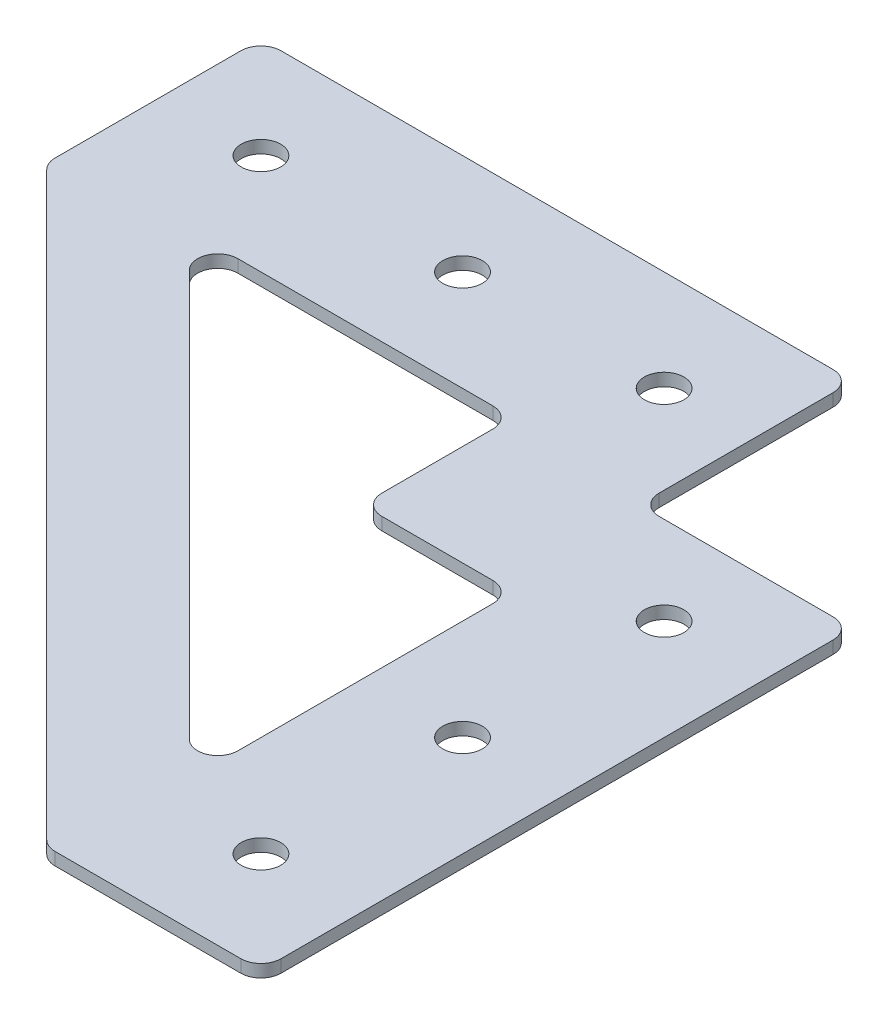
ISO-10303-21;
HEADER;
FILE_DESCRIPTION(('STEP AP214'),'2;1');
FILE_NAME('part.step','',(''),(''),'','','');
FILE_SCHEMA(('AUTOMOTIVE_DESIGN { 1 0 10303 214 1 1 1 1 }'));
ENDSEC;
DATA;
#1=APPLICATION_CONTEXT('core data for automotive mechanical design processes');
#2=APPLICATION_PROTOCOL_DEFINITION('international standard','automotive_design',2000,#1);
#3=PRODUCT_CONTEXT('',#1,'mechanical');
#4=PRODUCT('Part','Part','',(#3));
#5=PRODUCT_RELATED_PRODUCT_CATEGORY('part','',(#4));
#6=PRODUCT_DEFINITION_FORMATION('','',#4);
#7=PRODUCT_DEFINITION_CONTEXT('part definition',#1,'design');
#8=PRODUCT_DEFINITION('design','',#6,#7);
#9=PRODUCT_DEFINITION_SHAPE('','',#8);
#10=(LENGTH_UNIT() NAMED_UNIT(*) SI_UNIT(.MILLI.,.METRE.));
#11=(NAMED_UNIT(*) PLANE_ANGLE_UNIT() SI_UNIT($,.RADIAN.));
#12=(NAMED_UNIT(*) SI_UNIT($,.STERADIAN.) SOLID_ANGLE_UNIT());
#13=UNCERTAINTY_MEASURE_WITH_UNIT(LENGTH_MEASURE(1.E-05),#10,'distance_accuracy_value','');
#14=(GEOMETRIC_REPRESENTATION_CONTEXT(3) GLOBAL_UNCERTAINTY_ASSIGNED_CONTEXT((#13)) GLOBAL_UNIT_ASSIGNED_CONTEXT((#10,
#11,#12)) REPRESENTATION_CONTEXT('',''));
#15=CARTESIAN_POINT('',(0.,0.,0.));
#16=DIRECTION('',(0.,0.,1.));
#17=DIRECTION('',(1.,0.,0.));
#18=AXIS2_PLACEMENT_3D('',#15,#16,#17);
#19=CARTESIAN_POINT('',(-12.7,0.,38.1));
#20=DIRECTION('',(0.,1.,0.));
#21=DIRECTION('',(0.,0.,1.));
#22=AXIS2_PLACEMENT_3D('',#19,#20,#21);
#23=CYLINDRICAL_SURFACE('',#22,2.4892);
#24=CARTESIAN_POINT('',(-12.7,0.,38.1));
#25=DIRECTION('',(0.,1.,0.));
#26=DIRECTION('',(0.,0.,1.));
#27=AXIS2_PLACEMENT_3D('',#24,#25,#26);
#28=CIRCLE('',#27,2.4892);
#29=CARTESIAN_POINT('',(-12.7,0.,40.5892));
#30=VERTEX_POINT('',#29);
#31=EDGE_CURVE('E44',#30,#30,#28,.T.);
#32=ORIENTED_EDGE('',*,*,#31,.F.);
#33=EDGE_LOOP('',(#32));
#34=FACE_BOUND('',#33,.T.);
#35=CARTESIAN_POINT('',(-12.7,1.5875,38.1));
#36=DIRECTION('',(0.,1.,0.));
#37=DIRECTION('',(0.,0.,1.));
#38=AXIS2_PLACEMENT_3D('',#35,#36,#37);
#39=CIRCLE('',#38,2.4892);
#40=CARTESIAN_POINT('',(-12.7,1.5875,40.5892));
#41=VERTEX_POINT('',#40);
#42=EDGE_CURVE('E11',#41,#41,#39,.T.);
#43=ORIENTED_EDGE('',*,*,#42,.T.);
#44=EDGE_LOOP('',(#43));
#45=FACE_BOUND('',#44,.T.);
#46=ADVANCED_FACE('F36',(#34,#45),#23,.F.);
#47=CARTESIAN_POINT('',(-12.7,0.,63.5));
#48=DIRECTION('',(0.,1.,0.));
#49=DIRECTION('',(0.,0.,1.));
#50=AXIS2_PLACEMENT_3D('',#47,#48,#49);
#51=CYLINDRICAL_SURFACE('',#50,2.4892);
#52=CARTESIAN_POINT('',(-12.7,0.,63.5));
#53=DIRECTION('',(0.,1.,0.));
#54=DIRECTION('',(0.,0.,1.));
#55=AXIS2_PLACEMENT_3D('',#52,#53,#54);
#56=CIRCLE('',#55,2.4892);
#57=CARTESIAN_POINT('',(-12.7,0.,65.9892));
#58=VERTEX_POINT('',#57);
#59=EDGE_CURVE('E398',#58,#58,#56,.T.);
#60=ORIENTED_EDGE('',*,*,#59,.F.);
#61=EDGE_LOOP('',(#60));
#62=FACE_BOUND('',#61,.T.);
#63=CARTESIAN_POINT('',(-12.7,1.5875,63.5));
#64=DIRECTION('',(0.,1.,0.));
#65=DIRECTION('',(0.,0.,1.));
#66=AXIS2_PLACEMENT_3D('',#63,#64,#65);
#67=CIRCLE('',#66,2.4892);
#68=CARTESIAN_POINT('',(-12.7,1.5875,65.9892));
#69=VERTEX_POINT('',#68);
#70=EDGE_CURVE('E402',#69,#69,#67,.T.);
#71=ORIENTED_EDGE('',*,*,#70,.T.);
#72=EDGE_LOOP('',(#71));
#73=FACE_BOUND('',#72,.T.);
#74=ADVANCED_FACE('F414',(#62,#73),#51,.F.);
#75=CARTESIAN_POINT('',(-38.1,0.,12.7));
#76=DIRECTION('',(0.,1.,0.));
#77=DIRECTION('',(0.,0.,1.));
#78=AXIS2_PLACEMENT_3D('',#75,#76,#77);
#79=CYLINDRICAL_SURFACE('',#78,2.4892);
#80=CARTESIAN_POINT('',(-38.1,0.,12.7));
#81=DIRECTION('',(0.,1.,0.));
#82=DIRECTION('',(0.,0.,1.));
#83=AXIS2_PLACEMENT_3D('',#80,#81,#82);
#84=CIRCLE('',#83,2.4892);
#85=CARTESIAN_POINT('',(-38.1,0.,15.1892));
#86=VERTEX_POINT('',#85);
#87=EDGE_CURVE('E390',#86,#86,#84,.T.);
#88=ORIENTED_EDGE('',*,*,#87,.F.);
#89=EDGE_LOOP('',(#88));
#90=FACE_BOUND('',#89,.T.);
#91=CARTESIAN_POINT('',(-38.1,1.5875,12.7));
#92=DIRECTION('',(0.,1.,0.));
#93=DIRECTION('',(0.,0.,1.));
#94=AXIS2_PLACEMENT_3D('',#91,#92,#93);
#95=CIRCLE('',#94,2.4892);
#96=CARTESIAN_POINT('',(-38.1,1.5875,15.1892));
#97=VERTEX_POINT('',#96);
#98=EDGE_CURVE('E394',#97,#97,#95,.T.);
#99=ORIENTED_EDGE('',*,*,#98,.T.);
#100=EDGE_LOOP('',(#99));
#101=FACE_BOUND('',#100,.T.);
#102=ADVANCED_FACE('F628',(#90,#101),#79,.F.);
#103=CARTESIAN_POINT('',(-63.5,0.,12.7));
#104=DIRECTION('',(0.,1.,0.));
#105=DIRECTION('',(0.,0.,1.));
#106=AXIS2_PLACEMENT_3D('',#103,#104,#105);
#107=CYLINDRICAL_SURFACE('',#106,2.4892);
#108=CARTESIAN_POINT('',(-63.5,0.,12.7));
#109=DIRECTION('',(0.,1.,0.));
#110=DIRECTION('',(0.,0.,1.));
#111=AXIS2_PLACEMENT_3D('',#108,#109,#110);
#112=CIRCLE('',#111,2.4892);
#113=CARTESIAN_POINT('',(-63.5,0.,15.1892));
#114=VERTEX_POINT('',#113);
#115=EDGE_CURVE('E382',#114,#114,#112,.T.);
#116=ORIENTED_EDGE('',*,*,#115,.F.);
#117=EDGE_LOOP('',(#116));
#118=FACE_BOUND('',#117,.T.);
#119=CARTESIAN_POINT('',(-63.5,1.5875,12.7));
#120=DIRECTION('',(0.,1.,0.));
#121=DIRECTION('',(0.,0.,1.));
#122=AXIS2_PLACEMENT_3D('',#119,#120,#121);
#123=CIRCLE('',#122,2.4892);
#124=CARTESIAN_POINT('',(-63.5,1.5875,15.1892));
#125=VERTEX_POINT('',#124);
#126=EDGE_CURVE('E386',#125,#125,#123,.T.);
#127=ORIENTED_EDGE('',*,*,#126,.T.);
#128=EDGE_LOOP('',(#127));
#129=FACE_BOUND('',#128,.T.);
#130=ADVANCED_FACE('F420',(#118,#129),#107,.F.);
#131=CARTESIAN_POINT('',(0.,1.5875,0.));
#132=DIRECTION('',(0.,-1.,0.));
#133=DIRECTION('',(0.,0.,-1.));
#134=AXIS2_PLACEMENT_3D('',#131,#132,#133);
#135=PLANE('',#134);
#136=ORIENTED_EDGE('',*,*,#42,.F.);
#137=EDGE_LOOP('',(#136));
#138=FACE_BOUND('',#137,.T.);
#139=ORIENTED_EDGE('',*,*,#70,.F.);
#140=EDGE_LOOP('',(#139));
#141=FACE_BOUND('',#140,.T.);
#142=ORIENTED_EDGE('',*,*,#98,.F.);
#143=EDGE_LOOP('',(#142));
#144=FACE_BOUND('',#143,.T.);
#145=ORIENTED_EDGE('',*,*,#126,.F.);
#146=EDGE_LOOP('',(#145));
#147=FACE_BOUND('',#146,.T.);
#148=CARTESIAN_POINT('',(-88.9,1.5875,12.7));
#149=DIRECTION('',(0.,1.,0.));
#150=DIRECTION('',(0.,0.,1.));
#151=AXIS2_PLACEMENT_3D('',#148,#149,#150);
#152=CIRCLE('',#151,2.4892);
#153=CARTESIAN_POINT('',(-88.9,1.5875,15.1892));
#154=VERTEX_POINT('',#153);
#155=EDGE_CURVE('E431',#154,#154,#152,.T.);
#156=ORIENTED_EDGE('',*,*,#155,.F.);
#157=EDGE_LOOP('',(#156));
#158=FACE_BOUND('',#157,.T.);
#159=CARTESIAN_POINT('',(-12.7,1.5875,88.9));
#160=DIRECTION('',(0.,1.,0.));
#161=DIRECTION('',(0.,0.,1.));
#162=AXIS2_PLACEMENT_3D('',#159,#160,#161);
#163=CIRCLE('',#162,2.4892);
#164=CARTESIAN_POINT('',(-12.7,1.5875,91.3892));
#165=VERTEX_POINT('',#164);
#166=EDGE_CURVE('E434',#165,#165,#163,.T.);
#167=ORIENTED_EDGE('',*,*,#166,.F.);
#168=EDGE_LOOP('',(#167));
#169=FACE_BOUND('',#168,.T.);
#170=DIRECTION('',(0.,0.,-1.));
#171=VECTOR('',#170,1.);
#172=CARTESIAN_POINT('',(0.,1.5875,26.9875));
#173=LINE('',#172,#171);
#174=CARTESIAN_POINT('',(0.,1.5875,99.06));
#175=VERTEX_POINT('',#174);
#176=CARTESIAN_POINT('',(0.,1.5875,29.5275));
#177=VERTEX_POINT('',#176);
#178=EDGE_CURVE('E236',#175,#177,#173,.T.);
#179=ORIENTED_EDGE('',*,*,#178,.T.);
#180=CARTESIAN_POINT('',(-2.54,1.5875,29.5275));
#181=DIRECTION('',(0.,-1.,0.));
#182=DIRECTION('',(0.,0.,-1.));
#183=AXIS2_PLACEMENT_3D('',#180,#181,#182);
#184=CIRCLE('',#183,2.54);
#185=CARTESIAN_POINT('',(-2.54,1.5875,26.9875));
#186=VERTEX_POINT('',#185);
#187=EDGE_CURVE('E58',#177,#186,#184,.F.);
#188=ORIENTED_EDGE('',*,*,#187,.T.);
#189=DIRECTION('',(-1.,0.,0.));
#190=VECTOR('',#189,1.);
#191=CARTESIAN_POINT('',(0.,1.5875,26.9875));
#192=LINE('',#191,#190);
#193=CARTESIAN_POINT('',(-24.4475,1.5875,26.9875));
#194=VERTEX_POINT('',#193);
#195=EDGE_CURVE('E229',#186,#194,#192,.T.);
#196=ORIENTED_EDGE('',*,*,#195,.T.);
#197=CARTESIAN_POINT('',(-24.4475,1.5875,24.4475));
#198=DIRECTION('',(0.,-1.,0.));
#199=DIRECTION('',(0.,0.,-1.));
#200=AXIS2_PLACEMENT_3D('',#197,#198,#199);
#201=CIRCLE('',#200,2.54);
#202=CARTESIAN_POINT('',(-26.9875,1.5875,24.4475));
#203=VERTEX_POINT('',#202);
#204=EDGE_CURVE('E379',#194,#203,#201,.T.);
#205=ORIENTED_EDGE('',*,*,#204,.T.);
#206=DIRECTION('',(0.,0.,-1.));
#207=VECTOR('',#206,1.);
#208=CARTESIAN_POINT('',(-26.9875,1.5875,0.));
#209=LINE('',#208,#207);
#210=CARTESIAN_POINT('',(-26.9875,1.5875,2.54));
#211=VERTEX_POINT('',#210);
#212=EDGE_CURVE('E469',#203,#211,#209,.T.);
#213=ORIENTED_EDGE('',*,*,#212,.T.);
#214=CARTESIAN_POINT('',(-29.5275,1.5875,2.54));
#215=DIRECTION('',(0.,-1.,0.));
#216=DIRECTION('',(0.,0.,-1.));
#217=AXIS2_PLACEMENT_3D('',#214,#215,#216);
#218=CIRCLE('',#217,2.54);
#219=CARTESIAN_POINT('',(-29.5275,1.5875,0.));
#220=VERTEX_POINT('',#219);
#221=EDGE_CURVE('E292',#211,#220,#218,.F.);
#222=ORIENTED_EDGE('',*,*,#221,.T.);
#223=DIRECTION('',(-1.,0.,0.));
#224=VECTOR('',#223,1.);
#225=CARTESIAN_POINT('',(-26.9875,1.5875,0.));
#226=LINE('',#225,#224);
#227=CARTESIAN_POINT('',(-99.06,1.5875,0.));
#228=VERTEX_POINT('',#227);
#229=EDGE_CURVE('E473',#220,#228,#226,.T.);
#230=ORIENTED_EDGE('',*,*,#229,.T.);
#231=CARTESIAN_POINT('',(-99.06,1.5875,2.54));
#232=DIRECTION('',(0.,-1.,0.));
#233=DIRECTION('',(0.,0.,-1.));
#234=AXIS2_PLACEMENT_3D('',#231,#232,#233);
#235=CIRCLE('',#234,2.54);
#236=CARTESIAN_POINT('',(-101.6,1.5875,2.54));
#237=VERTEX_POINT('',#236);
#238=EDGE_CURVE('E295',#228,#237,#235,.F.);
#239=ORIENTED_EDGE('',*,*,#238,.T.);
#240=DIRECTION('',(0.,0.,1.));
#241=VECTOR('',#240,1.);
#242=CARTESIAN_POINT('',(-101.6,1.5875,0.));
#243=LINE('',#242,#241);
#244=CARTESIAN_POINT('',(-101.6,1.5875,25.9353975515723));
#245=VERTEX_POINT('',#244);
#246=EDGE_CURVE('E477',#237,#245,#243,.T.);
#247=ORIENTED_EDGE('',*,*,#246,.T.);
#248=CARTESIAN_POINT('',(-99.06,1.5875,25.9353975515723));
#249=DIRECTION('',(0.,-1.,0.));
#250=DIRECTION('',(0.,0.,-1.));
#251=AXIS2_PLACEMENT_3D('',#248,#249,#250);
#252=CIRCLE('',#251,2.54);
#253=CARTESIAN_POINT('',(-100.856051224214,1.5875,27.7314487757862));
#254=VERTEX_POINT('',#253);
#255=EDGE_CURVE('E298',#245,#254,#252,.F.);
#256=ORIENTED_EDGE('',*,*,#255,.T.);
#257=DIRECTION('',(0.707106781186548,0.,0.707106781186547));
#258=VECTOR('',#257,1.);
#259=CARTESIAN_POINT('',(-101.6,1.5875,26.9875));
#260=LINE('',#259,#258);
#261=CARTESIAN_POINT('',(-27.7314487757861,1.5875,100.856051224214));
#262=VERTEX_POINT('',#261);
#263=EDGE_CURVE('E481',#254,#262,#260,.T.);
#264=ORIENTED_EDGE('',*,*,#263,.T.);
#265=CARTESIAN_POINT('',(-25.9353975515723,1.5875,99.06));
#266=DIRECTION('',(0.,-1.,0.));
#267=DIRECTION('',(0.,0.,-1.));
#268=AXIS2_PLACEMENT_3D('',#265,#266,#267);
#269=CIRCLE('',#268,2.54);
#270=CARTESIAN_POINT('',(-25.9353975515723,1.5875,101.6));
#271=VERTEX_POINT('',#270);
#272=EDGE_CURVE('E301',#262,#271,#269,.F.);
#273=ORIENTED_EDGE('',*,*,#272,.T.);
#274=DIRECTION('',(1.,0.,0.));
#275=VECTOR('',#274,1.);
#276=CARTESIAN_POINT('',(0.,1.5875,101.6));
#277=LINE('',#276,#275);
#278=CARTESIAN_POINT('',(-2.53999999999999,1.5875,101.6));
#279=VERTEX_POINT('',#278);
#280=EDGE_CURVE('E485',#271,#279,#277,.T.);
#281=ORIENTED_EDGE('',*,*,#280,.T.);
#282=CARTESIAN_POINT('',(-2.53999999999999,1.5875,99.06));
#283=DIRECTION('',(0.,-1.,0.));
#284=DIRECTION('',(0.,0.,-1.));
#285=AXIS2_PLACEMENT_3D('',#282,#283,#284);
#286=CIRCLE('',#285,2.54);
#287=EDGE_CURVE('E289',#279,#175,#286,.F.);
#288=ORIENTED_EDGE('',*,*,#287,.T.);
#289=EDGE_LOOP('',(#179,#188,#196,#205,#213,#222,#230,#239,#247,#256,#264,#273,#281,#288));
#290=FACE_BOUND('',#289,.T.);
#291=DIRECTION('',(0.,0.,-1.));
#292=VECTOR('',#291,1.);
#293=CARTESIAN_POINT('',(-44.45,1.5875,25.4));
#294=LINE('',#293,#292);
#295=CARTESIAN_POINT('',(-44.45,1.5875,41.91));
#296=VERTEX_POINT('',#295);
#297=CARTESIAN_POINT('',(-44.45,1.5875,27.94));
#298=VERTEX_POINT('',#297);
#299=EDGE_CURVE('E439',#296,#298,#294,.T.);
#300=ORIENTED_EDGE('',*,*,#299,.F.);
#301=CARTESIAN_POINT('',(-41.91,1.5875,41.91));
#302=DIRECTION('',(0.,-1.,0.));
#303=DIRECTION('',(0.,0.,-1.));
#304=AXIS2_PLACEMENT_3D('',#301,#302,#303);
#305=CIRCLE('',#304,2.54);
#306=CARTESIAN_POINT('',(-41.91,1.5875,44.45));
#307=VERTEX_POINT('',#306);
#308=EDGE_CURVE('E306',#296,#307,#305,.F.);
#309=ORIENTED_EDGE('',*,*,#308,.T.);
#310=DIRECTION('',(-1.,0.,0.));
#311=VECTOR('',#310,1.);
#312=CARTESIAN_POINT('',(-25.4,1.5875,44.45));
#313=LINE('',#312,#311);
#314=CARTESIAN_POINT('',(-27.94,1.5875,44.45));
#315=VERTEX_POINT('',#314);
#316=EDGE_CURVE('E446',#315,#307,#313,.T.);
#317=ORIENTED_EDGE('',*,*,#316,.F.);
#318=CARTESIAN_POINT('',(-27.94,1.5875,46.99));
#319=DIRECTION('',(0.,-1.,0.));
#320=DIRECTION('',(0.,0.,-1.));
#321=AXIS2_PLACEMENT_3D('',#318,#319,#320);
#322=CIRCLE('',#321,2.54);
#323=CARTESIAN_POINT('',(-25.4,1.5875,46.99));
#324=VERTEX_POINT('',#323);
#325=EDGE_CURVE('E212',#315,#324,#322,.T.);
#326=ORIENTED_EDGE('',*,*,#325,.T.);
#327=DIRECTION('',(0.,0.,-1.));
#328=VECTOR('',#327,1.);
#329=CARTESIAN_POINT('',(-25.4,1.5875,44.45));
#330=LINE('',#329,#328);
#331=CARTESIAN_POINT('',(-25.4,1.5875,79.094885309434));
#332=VERTEX_POINT('',#331);
#333=EDGE_CURVE('E665',#332,#324,#330,.T.);
#334=ORIENTED_EDGE('',*,*,#333,.F.);
#335=CARTESIAN_POINT('',(-27.94,1.5875,79.094885309434));
#336=DIRECTION('',(0.,-1.,0.));
#337=DIRECTION('',(0.,0.,-1.));
#338=AXIS2_PLACEMENT_3D('',#335,#336,#337);
#339=CIRCLE('',#338,2.54);
#340=CARTESIAN_POINT('',(-29.7360512242138,1.5875,80.8909365336479));
#341=VERTEX_POINT('',#340);
#342=EDGE_CURVE('E366',#332,#341,#339,.T.);
#343=ORIENTED_EDGE('',*,*,#342,.T.);
#344=DIRECTION('',(0.707106781186548,0.,0.707106781186547));
#345=VECTOR('',#344,1.);
#346=CARTESIAN_POINT('',(-85.2269877578617,1.5875,25.4));
#347=LINE('',#346,#345);
#348=CARTESIAN_POINT('',(-80.8909365336479,1.5875,29.7360512242138));
#349=VERTEX_POINT('',#348);
#350=EDGE_CURVE('E661',#349,#341,#347,.T.);
#351=ORIENTED_EDGE('',*,*,#350,.F.);
#352=CARTESIAN_POINT('',(-79.094885309434,1.5875,27.94));
#353=DIRECTION('',(0.,-1.,0.));
#354=DIRECTION('',(0.,0.,-1.));
#355=AXIS2_PLACEMENT_3D('',#352,#353,#354);
#356=CIRCLE('',#355,2.54);
#357=CARTESIAN_POINT('',(-79.094885309434,1.5875,25.4));
#358=VERTEX_POINT('',#357);
#359=EDGE_CURVE('E360',#349,#358,#356,.T.);
#360=ORIENTED_EDGE('',*,*,#359,.T.);
#361=DIRECTION('',(-1.,0.,0.));
#362=VECTOR('',#361,1.);
#363=CARTESIAN_POINT('',(-44.45,1.5875,25.4));
#364=LINE('',#363,#362);
#365=CARTESIAN_POINT('',(-46.99,1.5875,25.4));
#366=VERTEX_POINT('',#365);
#367=EDGE_CURVE('E464',#366,#358,#364,.T.);
#368=ORIENTED_EDGE('',*,*,#367,.F.);
#369=CARTESIAN_POINT('',(-46.99,1.5875,27.94));
#370=DIRECTION('',(0.,-1.,0.));
#371=DIRECTION('',(0.,0.,-1.));
#372=AXIS2_PLACEMENT_3D('',#369,#370,#371);
#373=CIRCLE('',#372,2.54);
#374=EDGE_CURVE('E211',#366,#298,#373,.T.);
#375=ORIENTED_EDGE('',*,*,#374,.T.);
#376=EDGE_LOOP('',(#300,#309,#317,#326,#334,#343,#351,#360,#368,#375));
#377=FACE_BOUND('',#376,.T.);
#378=ADVANCED_FACE('F417',(#138,#141,#144,#147,#158,#169,#290,#377),#135,.F.);
#379=CARTESIAN_POINT('',(0.,0.,0.));
#380=DIRECTION('',(0.,-1.,0.));
#381=DIRECTION('',(0.,0.,-1.));
#382=AXIS2_PLACEMENT_3D('',#379,#380,#381);
#383=PLANE('',#382);
#384=ORIENTED_EDGE('',*,*,#31,.T.);
#385=EDGE_LOOP('',(#384));
#386=FACE_BOUND('',#385,.T.);
#387=ORIENTED_EDGE('',*,*,#59,.T.);
#388=EDGE_LOOP('',(#387));
#389=FACE_BOUND('',#388,.T.);
#390=ORIENTED_EDGE('',*,*,#87,.T.);
#391=EDGE_LOOP('',(#390));
#392=FACE_BOUND('',#391,.T.);
#393=ORIENTED_EDGE('',*,*,#115,.T.);
#394=EDGE_LOOP('',(#393));
#395=FACE_BOUND('',#394,.T.);
#396=CARTESIAN_POINT('',(-88.9,0.,12.7));
#397=DIRECTION('',(0.,1.,0.));
#398=DIRECTION('',(0.,0.,1.));
#399=AXIS2_PLACEMENT_3D('',#396,#397,#398);
#400=CIRCLE('',#399,2.4892);
#401=CARTESIAN_POINT('',(-88.9,0.,15.1892));
#402=VERTEX_POINT('',#401);
#403=EDGE_CURVE('E224',#402,#402,#400,.T.);
#404=ORIENTED_EDGE('',*,*,#403,.T.);
#405=EDGE_LOOP('',(#404));
#406=FACE_BOUND('',#405,.T.);
#407=CARTESIAN_POINT('',(-12.7,0.,88.9));
#408=DIRECTION('',(0.,1.,0.));
#409=DIRECTION('',(0.,0.,1.));
#410=AXIS2_PLACEMENT_3D('',#407,#408,#409);
#411=CIRCLE('',#410,2.4892);
#412=CARTESIAN_POINT('',(-12.7,0.,91.3892));
#413=VERTEX_POINT('',#412);
#414=EDGE_CURVE('E648',#413,#413,#411,.T.);
#415=ORIENTED_EDGE('',*,*,#414,.T.);
#416=EDGE_LOOP('',(#415));
#417=FACE_BOUND('',#416,.T.);
#418=DIRECTION('',(-1.,0.,0.));
#419=VECTOR('',#418,1.);
#420=CARTESIAN_POINT('',(0.,0.,26.9875));
#421=LINE('',#420,#419);
#422=CARTESIAN_POINT('',(-2.54,0.,26.9875));
#423=VERTEX_POINT('',#422);
#424=CARTESIAN_POINT('',(-24.4475,0.,26.9875));
#425=VERTEX_POINT('',#424);
#426=EDGE_CURVE('E239',#423,#425,#421,.T.);
#427=ORIENTED_EDGE('',*,*,#426,.F.);
#428=CARTESIAN_POINT('',(-2.54,0.,29.5275));
#429=DIRECTION('',(0.,-1.,0.));
#430=DIRECTION('',(0.,0.,-1.));
#431=AXIS2_PLACEMENT_3D('',#428,#429,#430);
#432=CIRCLE('',#431,2.54);
#433=CARTESIAN_POINT('',(0.,0.,29.5275));
#434=VERTEX_POINT('',#433);
#435=EDGE_CURVE('E277',#423,#434,#432,.T.);
#436=ORIENTED_EDGE('',*,*,#435,.T.);
#437=DIRECTION('',(0.,0.,-1.));
#438=VECTOR('',#437,1.);
#439=CARTESIAN_POINT('',(0.,0.,26.9875));
#440=LINE('',#439,#438);
#441=CARTESIAN_POINT('',(0.,0.,99.06));
#442=VERTEX_POINT('',#441);
#443=EDGE_CURVE('E509',#442,#434,#440,.T.);
#444=ORIENTED_EDGE('',*,*,#443,.F.);
#445=CARTESIAN_POINT('',(-2.53999999999999,0.,99.06));
#446=DIRECTION('',(0.,-1.,0.));
#447=DIRECTION('',(0.,0.,-1.));
#448=AXIS2_PLACEMENT_3D('',#445,#446,#447);
#449=CIRCLE('',#448,2.54);
#450=CARTESIAN_POINT('',(-2.53999999999999,0.,101.6));
#451=VERTEX_POINT('',#450);
#452=EDGE_CURVE('E262',#442,#451,#449,.T.);
#453=ORIENTED_EDGE('',*,*,#452,.T.);
#454=DIRECTION('',(1.,0.,0.));
#455=VECTOR('',#454,1.);
#456=CARTESIAN_POINT('',(0.,0.,101.6));
#457=LINE('',#456,#455);
#458=CARTESIAN_POINT('',(-25.9353975515723,0.,101.6));
#459=VERTEX_POINT('',#458);
#460=EDGE_CURVE('E506',#459,#451,#457,.T.);
#461=ORIENTED_EDGE('',*,*,#460,.F.);
#462=CARTESIAN_POINT('',(-25.9353975515723,0.,99.06));
#463=DIRECTION('',(0.,-1.,0.));
#464=DIRECTION('',(0.,0.,-1.));
#465=AXIS2_PLACEMENT_3D('',#462,#463,#464);
#466=CIRCLE('',#465,2.54);
#467=CARTESIAN_POINT('',(-27.7314487757861,0.,100.856051224214));
#468=VERTEX_POINT('',#467);
#469=EDGE_CURVE('E274',#459,#468,#466,.T.);
#470=ORIENTED_EDGE('',*,*,#469,.T.);
#471=DIRECTION('',(0.707106781186548,0.,0.707106781186547));
#472=VECTOR('',#471,1.);
#473=CARTESIAN_POINT('',(-101.6,0.,26.9875));
#474=LINE('',#473,#472);
#475=CARTESIAN_POINT('',(-100.856051224214,0.,27.7314487757862));
#476=VERTEX_POINT('',#475);
#477=EDGE_CURVE('E502',#476,#468,#474,.T.);
#478=ORIENTED_EDGE('',*,*,#477,.F.);
#479=CARTESIAN_POINT('',(-99.06,0.,25.9353975515723));
#480=DIRECTION('',(0.,-1.,0.));
#481=DIRECTION('',(0.,0.,-1.));
#482=AXIS2_PLACEMENT_3D('',#479,#480,#481);
#483=CIRCLE('',#482,2.54);
#484=CARTESIAN_POINT('',(-101.6,0.,25.9353975515723));
#485=VERTEX_POINT('',#484);
#486=EDGE_CURVE('E271',#476,#485,#483,.T.);
#487=ORIENTED_EDGE('',*,*,#486,.T.);
#488=DIRECTION('',(0.,0.,1.));
#489=VECTOR('',#488,1.);
#490=CARTESIAN_POINT('',(-101.6,0.,0.));
#491=LINE('',#490,#489);
#492=CARTESIAN_POINT('',(-101.6,0.,2.54));
#493=VERTEX_POINT('',#492);
#494=EDGE_CURVE('E498',#493,#485,#491,.T.);
#495=ORIENTED_EDGE('',*,*,#494,.F.);
#496=CARTESIAN_POINT('',(-99.06,0.,2.54));
#497=DIRECTION('',(0.,-1.,0.));
#498=DIRECTION('',(0.,0.,-1.));
#499=AXIS2_PLACEMENT_3D('',#496,#497,#498);
#500=CIRCLE('',#499,2.54);
#501=CARTESIAN_POINT('',(-99.06,0.,0.));
#502=VERTEX_POINT('',#501);
#503=EDGE_CURVE('E268',#493,#502,#500,.T.);
#504=ORIENTED_EDGE('',*,*,#503,.T.);
#505=DIRECTION('',(-1.,0.,0.));
#506=VECTOR('',#505,1.);
#507=CARTESIAN_POINT('',(-26.9875,0.,0.));
#508=LINE('',#507,#506);
#509=CARTESIAN_POINT('',(-29.5275,0.,0.));
#510=VERTEX_POINT('',#509);
#511=EDGE_CURVE('E494',#510,#502,#508,.T.);
#512=ORIENTED_EDGE('',*,*,#511,.F.);
#513=CARTESIAN_POINT('',(-29.5275,0.,2.54));
#514=DIRECTION('',(0.,-1.,0.));
#515=DIRECTION('',(0.,0.,-1.));
#516=AXIS2_PLACEMENT_3D('',#513,#514,#515);
#517=CIRCLE('',#516,2.54);
#518=CARTESIAN_POINT('',(-26.9875,0.,2.54));
#519=VERTEX_POINT('',#518);
#520=EDGE_CURVE('E265',#510,#519,#517,.T.);
#521=ORIENTED_EDGE('',*,*,#520,.T.);
#522=DIRECTION('',(0.,0.,-1.));
#523=VECTOR('',#522,1.);
#524=CARTESIAN_POINT('',(-26.9875,0.,0.));
#525=LINE('',#524,#523);
#526=CARTESIAN_POINT('',(-26.9875,0.,24.4475));
#527=VERTEX_POINT('',#526);
#528=EDGE_CURVE('E445',#527,#519,#525,.T.);
#529=ORIENTED_EDGE('',*,*,#528,.F.);
#530=CARTESIAN_POINT('',(-24.4475,0.,24.4475));
#531=DIRECTION('',(0.,-1.,0.));
#532=DIRECTION('',(0.,0.,-1.));
#533=AXIS2_PLACEMENT_3D('',#530,#531,#532);
#534=CIRCLE('',#533,2.54);
#535=EDGE_CURVE('E376',#527,#425,#534,.F.);
#536=ORIENTED_EDGE('',*,*,#535,.T.);
#537=EDGE_LOOP('',(#427,#436,#444,#453,#461,#470,#478,#487,#495,#504,#512,#521,#529,#536));
#538=FACE_BOUND('',#537,.T.);
#539=DIRECTION('',(-1.,0.,0.));
#540=VECTOR('',#539,1.);
#541=CARTESIAN_POINT('',(-25.4,0.,44.45));
#542=LINE('',#541,#540);
#543=CARTESIAN_POINT('',(-27.94,0.,44.45));
#544=VERTEX_POINT('',#543);
#545=CARTESIAN_POINT('',(-41.91,0.,44.45));
#546=VERTEX_POINT('',#545);
#547=EDGE_CURVE('E455',#544,#546,#542,.T.);
#548=ORIENTED_EDGE('',*,*,#547,.T.);
#549=CARTESIAN_POINT('',(-41.91,0.,41.91));
#550=DIRECTION('',(0.,-1.,0.));
#551=DIRECTION('',(0.,0.,-1.));
#552=AXIS2_PLACEMENT_3D('',#549,#550,#551);
#553=CIRCLE('',#552,2.54);
#554=CARTESIAN_POINT('',(-44.45,0.,41.91));
#555=VERTEX_POINT('',#554);
#556=EDGE_CURVE('E280',#546,#555,#553,.T.);
#557=ORIENTED_EDGE('',*,*,#556,.T.);
#558=DIRECTION('',(0.,0.,-1.));
#559=VECTOR('',#558,1.);
#560=CARTESIAN_POINT('',(-44.45,0.,25.4));
#561=LINE('',#560,#559);
#562=CARTESIAN_POINT('',(-44.45,0.,27.94));
#563=VERTEX_POINT('',#562);
#564=EDGE_CURVE('E205',#555,#563,#561,.T.);
#565=ORIENTED_EDGE('',*,*,#564,.T.);
#566=CARTESIAN_POINT('',(-46.99,0.,27.94));
#567=DIRECTION('',(0.,-1.,0.));
#568=DIRECTION('',(0.,0.,-1.));
#569=AXIS2_PLACEMENT_3D('',#566,#567,#568);
#570=CIRCLE('',#569,2.54);
#571=CARTESIAN_POINT('',(-46.99,0.,25.4));
#572=VERTEX_POINT('',#571);
#573=EDGE_CURVE('E199',#563,#572,#570,.F.);
#574=ORIENTED_EDGE('',*,*,#573,.T.);
#575=DIRECTION('',(-1.,0.,0.));
#576=VECTOR('',#575,1.);
#577=CARTESIAN_POINT('',(-44.45,0.,25.4));
#578=LINE('',#577,#576);
#579=CARTESIAN_POINT('',(-79.094885309434,0.,25.4));
#580=VERTEX_POINT('',#579);
#581=EDGE_CURVE('E203',#572,#580,#578,.T.);
#582=ORIENTED_EDGE('',*,*,#581,.T.);
#583=CARTESIAN_POINT('',(-79.094885309434,0.,27.94));
#584=DIRECTION('',(0.,-1.,0.));
#585=DIRECTION('',(0.,0.,-1.));
#586=AXIS2_PLACEMENT_3D('',#583,#584,#585);
#587=CIRCLE('',#586,2.54);
#588=CARTESIAN_POINT('',(-80.8909365336479,0.,29.7360512242138));
#589=VERTEX_POINT('',#588);
#590=EDGE_CURVE('E357',#580,#589,#587,.F.);
#591=ORIENTED_EDGE('',*,*,#590,.T.);
#592=DIRECTION('',(0.707106781186548,0.,0.707106781186547));
#593=VECTOR('',#592,1.);
#594=CARTESIAN_POINT('',(-85.2269877578617,0.,25.4));
#595=LINE('',#594,#593);
#596=CARTESIAN_POINT('',(-29.7360512242138,0.,80.8909365336479));
#597=VERTEX_POINT('',#596);
#598=EDGE_CURVE('E223',#589,#597,#595,.T.);
#599=ORIENTED_EDGE('',*,*,#598,.T.);
#600=CARTESIAN_POINT('',(-27.94,0.,79.094885309434));
#601=DIRECTION('',(0.,-1.,0.));
#602=DIRECTION('',(0.,0.,-1.));
#603=AXIS2_PLACEMENT_3D('',#600,#601,#602);
#604=CIRCLE('',#603,2.54);
#605=CARTESIAN_POINT('',(-25.4,0.,79.094885309434));
#606=VERTEX_POINT('',#605);
#607=EDGE_CURVE('E363',#597,#606,#604,.F.);
#608=ORIENTED_EDGE('',*,*,#607,.T.);
#609=DIRECTION('',(0.,0.,-1.));
#610=VECTOR('',#609,1.);
#611=CARTESIAN_POINT('',(-25.4,0.,44.45));
#612=LINE('',#611,#610);
#613=CARTESIAN_POINT('',(-25.4,0.,46.99));
#614=VERTEX_POINT('',#613);
#615=EDGE_CURVE('E459',#606,#614,#612,.T.);
#616=ORIENTED_EDGE('',*,*,#615,.T.);
#617=CARTESIAN_POINT('',(-27.94,0.,46.99));
#618=DIRECTION('',(0.,-1.,0.));
#619=DIRECTION('',(0.,0.,-1.));
#620=AXIS2_PLACEMENT_3D('',#617,#618,#619);
#621=CIRCLE('',#620,2.54);
#622=EDGE_CURVE('E369',#614,#544,#621,.F.);
#623=ORIENTED_EDGE('',*,*,#622,.T.);
#624=EDGE_LOOP('',(#548,#557,#565,#574,#582,#591,#599,#608,#616,#623));
#625=FACE_BOUND('',#624,.T.);
#626=ADVANCED_FACE('F202',(#386,#389,#392,#395,#406,#417,#538,#625),#383,.T.);
#627=CARTESIAN_POINT('',(-26.9875,1.5875,0.));
#628=DIRECTION('',(-1.,0.,0.));
#629=DIRECTION('',(0.,0.,1.));
#630=AXIS2_PLACEMENT_3D('',#627,#628,#629);
#631=PLANE('',#630);
#632=ORIENTED_EDGE('',*,*,#212,.F.);
#633=DIRECTION('',(0.,-1.,0.));
#634=VECTOR('',#633,1.);
#635=CARTESIAN_POINT('',(-26.9875,0.,24.4475));
#636=LINE('',#635,#634);
#637=EDGE_CURVE('E312',#203,#527,#636,.T.);
#638=ORIENTED_EDGE('',*,*,#637,.T.);
#639=ORIENTED_EDGE('',*,*,#528,.T.);
#640=DIRECTION('',(0.,-1.,0.));
#641=VECTOR('',#640,1.);
#642=CARTESIAN_POINT('',(-26.9875,1.5875,2.54));
#643=LINE('',#642,#641);
#644=EDGE_CURVE('E309',#519,#211,#643,.F.);
#645=ORIENTED_EDGE('',*,*,#644,.T.);
#646=EDGE_LOOP('',(#632,#638,#639,#645));
#647=FACE_BOUND('',#646,.T.);
#648=ADVANCED_FACE('F529',(#647),#631,.F.);
#649=CARTESIAN_POINT('',(-26.9875,1.5875,0.));
#650=DIRECTION('',(0.,0.,1.));
#651=DIRECTION('',(1.,0.,0.));
#652=AXIS2_PLACEMENT_3D('',#649,#650,#651);
#653=PLANE('',#652);
#654=ORIENTED_EDGE('',*,*,#511,.T.);
#655=DIRECTION('',(0.,-1.,0.));
#656=VECTOR('',#655,1.);
#657=CARTESIAN_POINT('',(-99.06,1.5875,0.));
#658=LINE('',#657,#656);
#659=EDGE_CURVE('E354',#502,#228,#658,.F.);
#660=ORIENTED_EDGE('',*,*,#659,.T.);
#661=ORIENTED_EDGE('',*,*,#229,.F.);
#662=DIRECTION('',(0.,-1.,0.));
#663=VECTOR('',#662,1.);
#664=CARTESIAN_POINT('',(-29.5275,1.5875,0.));
#665=LINE('',#664,#663);
#666=EDGE_CURVE('E350',#220,#510,#665,.T.);
#667=ORIENTED_EDGE('',*,*,#666,.T.);
#668=EDGE_LOOP('',(#654,#660,#661,#667));
#669=FACE_BOUND('',#668,.T.);
#670=ADVANCED_FACE('F538',(#669),#653,.F.);
#671=CARTESIAN_POINT('',(-101.6,1.5875,0.));
#672=DIRECTION('',(1.,0.,0.));
#673=DIRECTION('',(0.,0.,-1.));
#674=AXIS2_PLACEMENT_3D('',#671,#672,#673);
#675=PLANE('',#674);
#676=ORIENTED_EDGE('',*,*,#494,.T.);
#677=DIRECTION('',(0.,-1.,0.));
#678=VECTOR('',#677,1.);
#679=CARTESIAN_POINT('',(-101.6,1.5875,25.9353975515723));
#680=LINE('',#679,#678);
#681=EDGE_CURVE('E347',#485,#245,#680,.F.);
#682=ORIENTED_EDGE('',*,*,#681,.T.);
#683=ORIENTED_EDGE('',*,*,#246,.F.);
#684=DIRECTION('',(0.,-1.,0.));
#685=VECTOR('',#684,1.);
#686=CARTESIAN_POINT('',(-101.6,1.5875,2.54));
#687=LINE('',#686,#685);
#688=EDGE_CURVE('E343',#237,#493,#687,.T.);
#689=ORIENTED_EDGE('',*,*,#688,.T.);
#690=EDGE_LOOP('',(#676,#682,#683,#689));
#691=FACE_BOUND('',#690,.T.);
#692=ADVANCED_FACE('F547',(#691),#675,.F.);
#693=CARTESIAN_POINT('',(-101.6,1.5875,26.9875));
#694=DIRECTION('',(0.707106781186547,0.,-0.707106781186548));
#695=DIRECTION('',(-0.707106781186548,0.,-0.707106781186547));
#696=AXIS2_PLACEMENT_3D('',#693,#694,#695);
#697=PLANE('',#696);
#698=ORIENTED_EDGE('',*,*,#477,.T.);
#699=DIRECTION('',(0.,-1.,0.));
#700=VECTOR('',#699,1.);
#701=CARTESIAN_POINT('',(-27.7314487757861,1.5875,100.856051224214));
#702=LINE('',#701,#700);
#703=EDGE_CURVE('E340',#468,#262,#702,.F.);
#704=ORIENTED_EDGE('',*,*,#703,.T.);
#705=ORIENTED_EDGE('',*,*,#263,.F.);
#706=DIRECTION('',(0.,-1.,0.));
#707=VECTOR('',#706,1.);
#708=CARTESIAN_POINT('',(-100.856051224214,1.5875,27.7314487757862));
#709=LINE('',#708,#707);
#710=EDGE_CURVE('E336',#254,#476,#709,.T.);
#711=ORIENTED_EDGE('',*,*,#710,.T.);
#712=EDGE_LOOP('',(#698,#704,#705,#711));
#713=FACE_BOUND('',#712,.T.);
#714=ADVANCED_FACE('F556',(#713),#697,.F.);
#715=CARTESIAN_POINT('',(0.,1.5875,101.6));
#716=DIRECTION('',(0.,0.,-1.));
#717=DIRECTION('',(-1.,0.,0.));
#718=AXIS2_PLACEMENT_3D('',#715,#716,#717);
#719=PLANE('',#718);
#720=ORIENTED_EDGE('',*,*,#280,.F.);
#721=DIRECTION('',(0.,-1.,0.));
#722=VECTOR('',#721,1.);
#723=CARTESIAN_POINT('',(-25.9353975515723,1.5875,101.6));
#724=LINE('',#723,#722);
#725=EDGE_CURVE('E332',#271,#459,#724,.T.);
#726=ORIENTED_EDGE('',*,*,#725,.T.);
#727=ORIENTED_EDGE('',*,*,#460,.T.);
#728=DIRECTION('',(0.,-1.,0.));
#729=VECTOR('',#728,1.);
#730=CARTESIAN_POINT('',(-2.53999999999999,1.5875,101.6));
#731=LINE('',#730,#729);
#732=EDGE_CURVE('E329',#451,#279,#731,.F.);
#733=ORIENTED_EDGE('',*,*,#732,.T.);
#734=EDGE_LOOP('',(#720,#726,#727,#733));
#735=FACE_BOUND('',#734,.T.);
#736=ADVANCED_FACE('F565',(#735),#719,.F.);
#737=CARTESIAN_POINT('',(0.,1.5875,26.9875));
#738=DIRECTION('',(-1.,0.,0.));
#739=DIRECTION('',(0.,0.,1.));
#740=AXIS2_PLACEMENT_3D('',#737,#738,#739);
#741=PLANE('',#740);
#742=ORIENTED_EDGE('',*,*,#443,.T.);
#743=DIRECTION('',(0.,-1.,0.));
#744=VECTOR('',#743,1.);
#745=CARTESIAN_POINT('',(0.,1.5875,29.5275));
#746=LINE('',#745,#744);
#747=EDGE_CURVE('E326',#434,#177,#746,.F.);
#748=ORIENTED_EDGE('',*,*,#747,.T.);
#749=ORIENTED_EDGE('',*,*,#178,.F.);
#750=DIRECTION('',(0.,-1.,0.));
#751=VECTOR('',#750,1.);
#752=CARTESIAN_POINT('',(0.,1.5875,99.06));
#753=LINE('',#752,#751);
#754=EDGE_CURVE('E322',#175,#442,#753,.T.);
#755=ORIENTED_EDGE('',*,*,#754,.T.);
#756=EDGE_LOOP('',(#742,#748,#749,#755));
#757=FACE_BOUND('',#756,.T.);
#758=ADVANCED_FACE('F571',(#757),#741,.F.);
#759=CARTESIAN_POINT('',(0.,1.5875,26.9875));
#760=DIRECTION('',(0.,0.,1.));
#761=DIRECTION('',(1.,0.,0.));
#762=AXIS2_PLACEMENT_3D('',#759,#760,#761);
#763=PLANE('',#762);
#764=ORIENTED_EDGE('',*,*,#426,.T.);
#765=DIRECTION('',(0.,-1.,0.));
#766=VECTOR('',#765,1.);
#767=CARTESIAN_POINT('',(-24.4475,1.5875,26.9875));
#768=LINE('',#767,#766);
#769=EDGE_CURVE('E51',#425,#194,#768,.F.);
#770=ORIENTED_EDGE('',*,*,#769,.T.);
#771=ORIENTED_EDGE('',*,*,#195,.F.);
#772=DIRECTION('',(0.,-1.,0.));
#773=VECTOR('',#772,1.);
#774=CARTESIAN_POINT('',(-2.54,1.5875,26.9875));
#775=LINE('',#774,#773);
#776=EDGE_CURVE('E316',#186,#423,#775,.T.);
#777=ORIENTED_EDGE('',*,*,#776,.T.);
#778=EDGE_LOOP('',(#764,#770,#771,#777));
#779=FACE_BOUND('',#778,.T.);
#780=ADVANCED_FACE('F519',(#779),#763,.F.);
#781=CARTESIAN_POINT('',(-44.45,1.5875,25.4));
#782=DIRECTION('',(0.,0.,1.));
#783=DIRECTION('',(1.,0.,0.));
#784=AXIS2_PLACEMENT_3D('',#781,#782,#783);
#785=PLANE('',#784);
#786=ORIENTED_EDGE('',*,*,#367,.T.);
#787=DIRECTION('',(0.,-1.,0.));
#788=VECTOR('',#787,1.);
#789=CARTESIAN_POINT('',(-79.094885309434,0.,25.4));
#790=LINE('',#789,#788);
#791=EDGE_CURVE('E221',#358,#580,#790,.T.);
#792=ORIENTED_EDGE('',*,*,#791,.T.);
#793=ORIENTED_EDGE('',*,*,#581,.F.);
#794=DIRECTION('',(0.,-1.,0.));
#795=VECTOR('',#794,1.);
#796=CARTESIAN_POINT('',(-46.99,1.5875,25.4));
#797=LINE('',#796,#795);
#798=EDGE_CURVE('E218',#572,#366,#797,.F.);
#799=ORIENTED_EDGE('',*,*,#798,.T.);
#800=EDGE_LOOP('',(#786,#792,#793,#799));
#801=FACE_BOUND('',#800,.T.);
#802=ADVANCED_FACE('F217',(#801),#785,.T.);
#803=CARTESIAN_POINT('',(-85.2269877578617,1.5875,25.4));
#804=DIRECTION('',(0.707106781186547,0.,-0.707106781186548));
#805=DIRECTION('',(-0.707106781186548,0.,-0.707106781186547));
#806=AXIS2_PLACEMENT_3D('',#803,#804,#805);
#807=PLANE('',#806);
#808=ORIENTED_EDGE('',*,*,#598,.F.);
#809=DIRECTION('',(0.,-1.,0.));
#810=VECTOR('',#809,1.);
#811=CARTESIAN_POINT('',(-80.8909365336479,1.5875,29.7360512242138));
#812=LINE('',#811,#810);
#813=EDGE_CURVE('E245',#589,#349,#812,.F.);
#814=ORIENTED_EDGE('',*,*,#813,.T.);
#815=ORIENTED_EDGE('',*,*,#350,.T.);
#816=DIRECTION('',(0.,-1.,0.));
#817=VECTOR('',#816,1.);
#818=CARTESIAN_POINT('',(-29.7360512242138,0.,80.8909365336479));
#819=LINE('',#818,#817);
#820=EDGE_CURVE('E234',#341,#597,#819,.T.);
#821=ORIENTED_EDGE('',*,*,#820,.T.);
#822=EDGE_LOOP('',(#808,#814,#815,#821));
#823=FACE_BOUND('',#822,.T.);
#824=ADVANCED_FACE('F677',(#823),#807,.T.);
#825=CARTESIAN_POINT('',(-25.4,1.5875,44.45));
#826=DIRECTION('',(-1.,0.,0.));
#827=DIRECTION('',(0.,0.,1.));
#828=AXIS2_PLACEMENT_3D('',#825,#826,#827);
#829=PLANE('',#828);
#830=ORIENTED_EDGE('',*,*,#615,.F.);
#831=DIRECTION('',(0.,-1.,0.));
#832=VECTOR('',#831,1.);
#833=CARTESIAN_POINT('',(-25.4,1.5875,79.094885309434));
#834=LINE('',#833,#832);
#835=EDGE_CURVE('E252',#606,#332,#834,.F.);
#836=ORIENTED_EDGE('',*,*,#835,.T.);
#837=ORIENTED_EDGE('',*,*,#333,.T.);
#838=DIRECTION('',(0.,-1.,0.));
#839=VECTOR('',#838,1.);
#840=CARTESIAN_POINT('',(-25.4,0.,46.99));
#841=LINE('',#840,#839);
#842=EDGE_CURVE('E248',#324,#614,#841,.T.);
#843=ORIENTED_EDGE('',*,*,#842,.T.);
#844=EDGE_LOOP('',(#830,#836,#837,#843));
#845=FACE_BOUND('',#844,.T.);
#846=ADVANCED_FACE('F685',(#845),#829,.T.);
#847=CARTESIAN_POINT('',(-25.4,1.5875,44.45));
#848=DIRECTION('',(0.,0.,1.));
#849=DIRECTION('',(1.,0.,0.));
#850=AXIS2_PLACEMENT_3D('',#847,#848,#849);
#851=PLANE('',#850);
#852=ORIENTED_EDGE('',*,*,#547,.F.);
#853=DIRECTION('',(0.,-1.,0.));
#854=VECTOR('',#853,1.);
#855=CARTESIAN_POINT('',(-27.94,1.5875,44.45));
#856=LINE('',#855,#854);
#857=EDGE_CURVE('E259',#544,#315,#856,.F.);
#858=ORIENTED_EDGE('',*,*,#857,.T.);
#859=ORIENTED_EDGE('',*,*,#316,.T.);
#860=DIRECTION('',(0.,-1.,0.));
#861=VECTOR('',#860,1.);
#862=CARTESIAN_POINT('',(-41.91,1.5875,44.45));
#863=LINE('',#862,#861);
#864=EDGE_CURVE('E255',#307,#546,#863,.T.);
#865=ORIENTED_EDGE('',*,*,#864,.T.);
#866=EDGE_LOOP('',(#852,#858,#859,#865));
#867=FACE_BOUND('',#866,.T.);
#868=ADVANCED_FACE('F454',(#867),#851,.T.);
#869=CARTESIAN_POINT('',(-44.45,1.5875,25.4));
#870=DIRECTION('',(-1.,0.,0.));
#871=DIRECTION('',(0.,0.,1.));
#872=AXIS2_PLACEMENT_3D('',#869,#870,#871);
#873=PLANE('',#872);
#874=ORIENTED_EDGE('',*,*,#564,.F.);
#875=DIRECTION('',(0.,-1.,0.));
#876=VECTOR('',#875,1.);
#877=CARTESIAN_POINT('',(-44.45,1.5875,41.91));
#878=LINE('',#877,#876);
#879=EDGE_CURVE('E286',#555,#296,#878,.F.);
#880=ORIENTED_EDGE('',*,*,#879,.T.);
#881=ORIENTED_EDGE('',*,*,#299,.T.);
#882=DIRECTION('',(0.,-1.,0.));
#883=VECTOR('',#882,1.);
#884=CARTESIAN_POINT('',(-44.45,0.,27.94));
#885=LINE('',#884,#883);
#886=EDGE_CURVE('E283',#298,#563,#885,.T.);
#887=ORIENTED_EDGE('',*,*,#886,.T.);
#888=EDGE_LOOP('',(#874,#880,#881,#887));
#889=FACE_BOUND('',#888,.T.);
#890=ADVANCED_FACE('F598',(#889),#873,.T.);
#891=CARTESIAN_POINT('',(-79.094885309434,1.5875,27.94));
#892=DIRECTION('',(0.,1.,0.));
#893=DIRECTION('',(0.,0.,1.));
#894=AXIS2_PLACEMENT_3D('',#891,#892,#893);
#895=CYLINDRICAL_SURFACE('',#894,2.54);
#896=ORIENTED_EDGE('',*,*,#359,.F.);
#897=ORIENTED_EDGE('',*,*,#813,.F.);
#898=ORIENTED_EDGE('',*,*,#590,.F.);
#899=ORIENTED_EDGE('',*,*,#791,.F.);
#900=EDGE_LOOP('',(#896,#897,#898,#899));
#901=FACE_BOUND('',#900,.T.);
#902=ADVANCED_FACE('F594',(#901),#895,.F.);
#903=CARTESIAN_POINT('',(-27.94,1.5875,79.094885309434));
#904=DIRECTION('',(0.,1.,0.));
#905=DIRECTION('',(0.,0.,1.));
#906=AXIS2_PLACEMENT_3D('',#903,#904,#905);
#907=CYLINDRICAL_SURFACE('',#906,2.54);
#908=ORIENTED_EDGE('',*,*,#342,.F.);
#909=ORIENTED_EDGE('',*,*,#835,.F.);
#910=ORIENTED_EDGE('',*,*,#607,.F.);
#911=ORIENTED_EDGE('',*,*,#820,.F.);
#912=EDGE_LOOP('',(#908,#909,#910,#911));
#913=FACE_BOUND('',#912,.T.);
#914=ADVANCED_FACE('F597',(#913),#907,.F.);
#915=CARTESIAN_POINT('',(-27.94,1.5875,46.99));
#916=DIRECTION('',(0.,1.,0.));
#917=DIRECTION('',(0.,0.,1.));
#918=AXIS2_PLACEMENT_3D('',#915,#916,#917);
#919=CYLINDRICAL_SURFACE('',#918,2.54);
#920=ORIENTED_EDGE('',*,*,#325,.F.);
#921=ORIENTED_EDGE('',*,*,#857,.F.);
#922=ORIENTED_EDGE('',*,*,#622,.F.);
#923=ORIENTED_EDGE('',*,*,#842,.F.);
#924=EDGE_LOOP('',(#920,#921,#922,#923));
#925=FACE_BOUND('',#924,.T.);
#926=ADVANCED_FACE('F602',(#925),#919,.F.);
#927=CARTESIAN_POINT('',(-41.91,1.5875,41.91));
#928=DIRECTION('',(0.,-1.,0.));
#929=DIRECTION('',(0.,0.,-1.));
#930=AXIS2_PLACEMENT_3D('',#927,#928,#929);
#931=CYLINDRICAL_SURFACE('',#930,2.54);
#932=ORIENTED_EDGE('',*,*,#308,.F.);
#933=ORIENTED_EDGE('',*,*,#879,.F.);
#934=ORIENTED_EDGE('',*,*,#556,.F.);
#935=ORIENTED_EDGE('',*,*,#864,.F.);
#936=EDGE_LOOP('',(#932,#933,#934,#935));
#937=FACE_BOUND('',#936,.T.);
#938=ADVANCED_FACE('F451',(#937),#931,.T.);
#939=CARTESIAN_POINT('',(-46.99,1.5875,27.94));
#940=DIRECTION('',(0.,1.,0.));
#941=DIRECTION('',(0.,0.,1.));
#942=AXIS2_PLACEMENT_3D('',#939,#940,#941);
#943=CYLINDRICAL_SURFACE('',#942,2.54);
#944=ORIENTED_EDGE('',*,*,#374,.F.);
#945=ORIENTED_EDGE('',*,*,#798,.F.);
#946=ORIENTED_EDGE('',*,*,#573,.F.);
#947=ORIENTED_EDGE('',*,*,#886,.F.);
#948=EDGE_LOOP('',(#944,#945,#946,#947));
#949=FACE_BOUND('',#948,.T.);
#950=ADVANCED_FACE('F227',(#949),#943,.F.);
#951=CARTESIAN_POINT('',(-24.4475,1.5875,24.4475));
#952=DIRECTION('',(0.,1.,0.));
#953=DIRECTION('',(0.,0.,1.));
#954=AXIS2_PLACEMENT_3D('',#951,#952,#953);
#955=CYLINDRICAL_SURFACE('',#954,2.54);
#956=ORIENTED_EDGE('',*,*,#204,.F.);
#957=ORIENTED_EDGE('',*,*,#769,.F.);
#958=ORIENTED_EDGE('',*,*,#535,.F.);
#959=ORIENTED_EDGE('',*,*,#637,.F.);
#960=EDGE_LOOP('',(#956,#957,#958,#959));
#961=FACE_BOUND('',#960,.T.);
#962=ADVANCED_FACE('F524',(#961),#955,.F.);
#963=CARTESIAN_POINT('',(-2.54,1.5875,29.5275));
#964=DIRECTION('',(0.,-1.,0.));
#965=DIRECTION('',(0.,0.,-1.));
#966=AXIS2_PLACEMENT_3D('',#963,#964,#965);
#967=CYLINDRICAL_SURFACE('',#966,2.54);
#968=ORIENTED_EDGE('',*,*,#187,.F.);
#969=ORIENTED_EDGE('',*,*,#747,.F.);
#970=ORIENTED_EDGE('',*,*,#435,.F.);
#971=ORIENTED_EDGE('',*,*,#776,.F.);
#972=EDGE_LOOP('',(#968,#969,#970,#971));
#973=FACE_BOUND('',#972,.T.);
#974=ADVANCED_FACE('F573',(#973),#967,.T.);
#975=CARTESIAN_POINT('',(-25.9353975515723,1.5875,99.06));
#976=DIRECTION('',(0.,-1.,0.));
#977=DIRECTION('',(0.,0.,-1.));
#978=AXIS2_PLACEMENT_3D('',#975,#976,#977);
#979=CYLINDRICAL_SURFACE('',#978,2.54);
#980=ORIENTED_EDGE('',*,*,#272,.F.);
#981=ORIENTED_EDGE('',*,*,#703,.F.);
#982=ORIENTED_EDGE('',*,*,#469,.F.);
#983=ORIENTED_EDGE('',*,*,#725,.F.);
#984=EDGE_LOOP('',(#980,#981,#982,#983));
#985=FACE_BOUND('',#984,.T.);
#986=ADVANCED_FACE('F560',(#985),#979,.T.);
#987=CARTESIAN_POINT('',(-99.06,1.5875,25.9353975515723));
#988=DIRECTION('',(0.,-1.,0.));
#989=DIRECTION('',(0.,0.,-1.));
#990=AXIS2_PLACEMENT_3D('',#987,#988,#989);
#991=CYLINDRICAL_SURFACE('',#990,2.54);
#992=ORIENTED_EDGE('',*,*,#255,.F.);
#993=ORIENTED_EDGE('',*,*,#681,.F.);
#994=ORIENTED_EDGE('',*,*,#486,.F.);
#995=ORIENTED_EDGE('',*,*,#710,.F.);
#996=EDGE_LOOP('',(#992,#993,#994,#995));
#997=FACE_BOUND('',#996,.T.);
#998=ADVANCED_FACE('F551',(#997),#991,.T.);
#999=CARTESIAN_POINT('',(-99.06,1.5875,2.54));
#1000=DIRECTION('',(0.,-1.,0.));
#1001=DIRECTION('',(0.,0.,-1.));
#1002=AXIS2_PLACEMENT_3D('',#999,#1000,#1001);
#1003=CYLINDRICAL_SURFACE('',#1002,2.54);
#1004=ORIENTED_EDGE('',*,*,#238,.F.);
#1005=ORIENTED_EDGE('',*,*,#659,.F.);
#1006=ORIENTED_EDGE('',*,*,#503,.F.);
#1007=ORIENTED_EDGE('',*,*,#688,.F.);
#1008=EDGE_LOOP('',(#1004,#1005,#1006,#1007));
#1009=FACE_BOUND('',#1008,.T.);
#1010=ADVANCED_FACE('F542',(#1009),#1003,.T.);
#1011=CARTESIAN_POINT('',(-29.5275,1.5875,2.54));
#1012=DIRECTION('',(0.,-1.,0.));
#1013=DIRECTION('',(0.,0.,-1.));
#1014=AXIS2_PLACEMENT_3D('',#1011,#1012,#1013);
#1015=CYLINDRICAL_SURFACE('',#1014,2.54);
#1016=ORIENTED_EDGE('',*,*,#221,.F.);
#1017=ORIENTED_EDGE('',*,*,#644,.F.);
#1018=ORIENTED_EDGE('',*,*,#520,.F.);
#1019=ORIENTED_EDGE('',*,*,#666,.F.);
#1020=EDGE_LOOP('',(#1016,#1017,#1018,#1019));
#1021=FACE_BOUND('',#1020,.T.);
#1022=ADVANCED_FACE('F533',(#1021),#1015,.T.);
#1023=CARTESIAN_POINT('',(-2.53999999999999,1.5875,99.06));
#1024=DIRECTION('',(0.,-1.,0.));
#1025=DIRECTION('',(0.,0.,-1.));
#1026=AXIS2_PLACEMENT_3D('',#1023,#1024,#1025);
#1027=CYLINDRICAL_SURFACE('',#1026,2.54);
#1028=ORIENTED_EDGE('',*,*,#287,.F.);
#1029=ORIENTED_EDGE('',*,*,#732,.F.);
#1030=ORIENTED_EDGE('',*,*,#452,.F.);
#1031=ORIENTED_EDGE('',*,*,#754,.F.);
#1032=EDGE_LOOP('',(#1028,#1029,#1030,#1031));
#1033=FACE_BOUND('',#1032,.T.);
#1034=ADVANCED_FACE('F569',(#1033),#1027,.T.);
#1035=CARTESIAN_POINT('',(-12.7,0.,88.9));
#1036=DIRECTION('',(0.,1.,0.));
#1037=DIRECTION('',(0.,0.,1.));
#1038=AXIS2_PLACEMENT_3D('',#1035,#1036,#1037);
#1039=CYLINDRICAL_SURFACE('',#1038,2.4892);
#1040=ORIENTED_EDGE('',*,*,#414,.F.);
#1041=EDGE_LOOP('',(#1040));
#1042=FACE_BOUND('',#1041,.T.);
#1043=ORIENTED_EDGE('',*,*,#166,.T.);
#1044=EDGE_LOOP('',(#1043));
#1045=FACE_BOUND('',#1044,.T.);
#1046=ADVANCED_FACE('F625',(#1042,#1045),#1039,.F.);
#1047=CARTESIAN_POINT('',(-88.9,0.,12.7));
#1048=DIRECTION('',(0.,1.,0.));
#1049=DIRECTION('',(0.,0.,1.));
#1050=AXIS2_PLACEMENT_3D('',#1047,#1048,#1049);
#1051=CYLINDRICAL_SURFACE('',#1050,2.4892);
#1052=ORIENTED_EDGE('',*,*,#403,.F.);
#1053=EDGE_LOOP('',(#1052));
#1054=FACE_BOUND('',#1053,.T.);
#1055=ORIENTED_EDGE('',*,*,#155,.T.);
#1056=EDGE_LOOP('',(#1055));
#1057=FACE_BOUND('',#1056,.T.);
#1058=ADVANCED_FACE('F804',(#1054,#1057),#1051,.F.);
#1059=CLOSED_SHELL('',(#46,#74,#102,#130,#378,#626,#648,#670,#692,#714,#736,#758,#780,#802,#824,
#846,#868,#890,#902,#914,#926,#938,#950,#962,#974,#986,#998,#1010,#1022,#1034,#1046,#1058));
#1060=MANIFOLD_SOLID_BREP('B2',#1059);
#1061=ADVANCED_BREP_SHAPE_REPRESENTATION('',(#18,#1060),#14);
#1062=SHAPE_DEFINITION_REPRESENTATION(#9,#1061);
ENDSEC;
END-ISO-10303-21;
